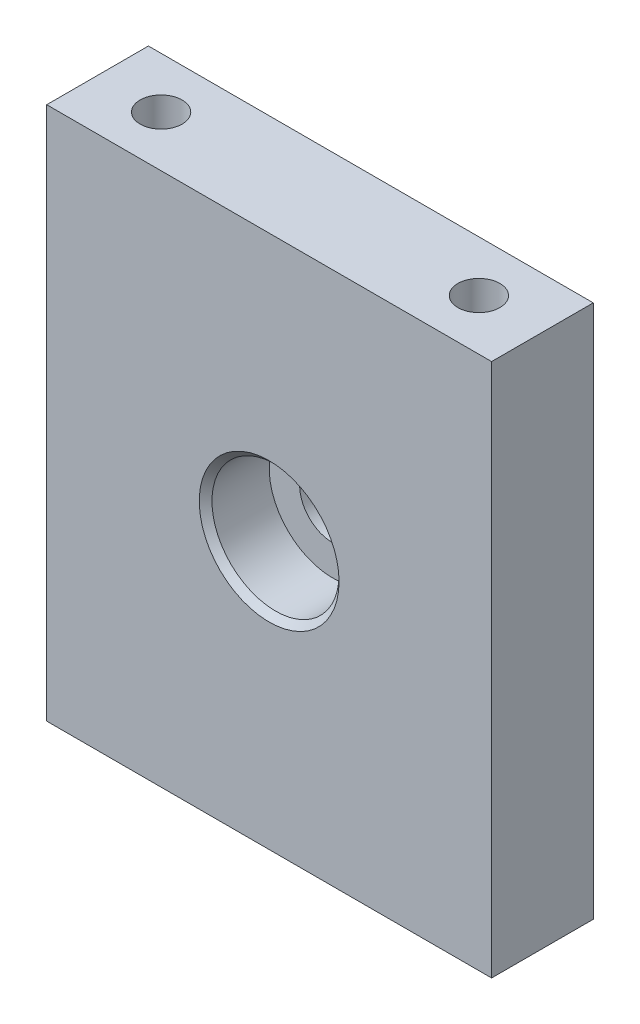
ISO-10303-21;
HEADER;
FILE_DESCRIPTION(('STEP AP214'),'2;1');
FILE_NAME('part.step','',(''),(''),'','','');
FILE_SCHEMA(('AUTOMOTIVE_DESIGN { 1 0 10303 214 1 1 1 1 }'));
ENDSEC;
DATA;
#1=APPLICATION_CONTEXT('core data for automotive mechanical design processes');
#2=APPLICATION_PROTOCOL_DEFINITION('international standard','automotive_design',2000,#1);
#3=PRODUCT_CONTEXT('',#1,'mechanical');
#4=PRODUCT('Part','Part','',(#3));
#5=PRODUCT_RELATED_PRODUCT_CATEGORY('part','',(#4));
#6=PRODUCT_DEFINITION_FORMATION('','',#4);
#7=PRODUCT_DEFINITION_CONTEXT('part definition',#1,'design');
#8=PRODUCT_DEFINITION('design','',#6,#7);
#9=PRODUCT_DEFINITION_SHAPE('','',#8);
#10=(LENGTH_UNIT() NAMED_UNIT(*) SI_UNIT(.MILLI.,.METRE.));
#11=(NAMED_UNIT(*) PLANE_ANGLE_UNIT() SI_UNIT($,.RADIAN.));
#12=(NAMED_UNIT(*) SI_UNIT($,.STERADIAN.) SOLID_ANGLE_UNIT());
#13=UNCERTAINTY_MEASURE_WITH_UNIT(LENGTH_MEASURE(1.E-05),#10,'distance_accuracy_value','');
#14=(GEOMETRIC_REPRESENTATION_CONTEXT(3) GLOBAL_UNCERTAINTY_ASSIGNED_CONTEXT((#13)) GLOBAL_UNIT_ASSIGNED_CONTEXT((#10,
#11,#12)) REPRESENTATION_CONTEXT('',''));
#15=CARTESIAN_POINT('',(0.,0.,0.));
#16=DIRECTION('',(0.,0.,1.));
#17=DIRECTION('',(1.,0.,0.));
#18=AXIS2_PLACEMENT_3D('',#15,#16,#17);
#19=CARTESIAN_POINT('',(0.,0.,-7.5));
#20=DIRECTION('',(0.,0.,1.));
#21=DIRECTION('',(1.,0.,0.));
#22=AXIS2_PLACEMENT_3D('',#19,#20,#21);
#23=CYLINDRICAL_SURFACE('',#22,2.6);
#24=CARTESIAN_POINT('',(0.,0.,-2.));
#25=DIRECTION('',(0.,0.,-1.));
#26=DIRECTION('',(-1.,0.,0.));
#27=AXIS2_PLACEMENT_3D('',#24,#25,#26);
#28=CIRCLE('',#27,2.6);
#29=CARTESIAN_POINT('',(-2.6,0.,-2.));
#30=VERTEX_POINT('',#29);
#31=EDGE_CURVE('E181',#30,#30,#28,.T.);
#32=ORIENTED_EDGE('',*,*,#31,.T.);
#33=EDGE_LOOP('',(#32));
#34=FACE_BOUND('',#33,.T.);
#35=CARTESIAN_POINT('',(0.,0.,-1.));
#36=DIRECTION('',(0.,0.,1.));
#37=DIRECTION('',(1.,0.,0.));
#38=AXIS2_PLACEMENT_3D('',#35,#36,#37);
#39=CIRCLE('',#38,2.6);
#40=CARTESIAN_POINT('',(2.6,0.,-1.));
#41=VERTEX_POINT('',#40);
#42=EDGE_CURVE('E184',#41,#41,#39,.F.);
#43=ORIENTED_EDGE('',*,*,#42,.F.);
#44=EDGE_LOOP('',(#43));
#45=FACE_BOUND('',#44,.T.);
#46=ADVANCED_FACE('F40',(#34,#45),#23,.F.);
#47=CARTESIAN_POINT('',(0.,0.,-4.));
#48=DIRECTION('',(0.,0.,1.));
#49=DIRECTION('',(1.,0.,0.));
#50=AXIS2_PLACEMENT_3D('',#47,#48,#49);
#51=PLANE('',#50);
#52=CARTESIAN_POINT('',(0.,0.,-4.));
#53=DIRECTION('',(0.,0.,1.));
#54=DIRECTION('',(1.,0.,0.));
#55=AXIS2_PLACEMENT_3D('',#52,#53,#54);
#56=CIRCLE('',#55,11.);
#57=CARTESIAN_POINT('',(11.,0.,-4.));
#58=VERTEX_POINT('',#57);
#59=EDGE_CURVE('E11',#58,#58,#56,.T.);
#60=ORIENTED_EDGE('',*,*,#59,.T.);
#61=EDGE_LOOP('',(#60));
#62=FACE_BOUND('',#61,.T.);
#63=DIRECTION('',(0.,1.,0.));
#64=VECTOR('',#63,1.);
#65=CARTESIAN_POINT('',(17.5,21.,-4.));
#66=LINE('',#65,#64);
#67=CARTESIAN_POINT('',(17.5,-21.,-4.));
#68=VERTEX_POINT('',#67);
#69=CARTESIAN_POINT('',(17.5,21.,-4.));
#70=VERTEX_POINT('',#69);
#71=EDGE_CURVE('E218',#68,#70,#66,.T.);
#72=ORIENTED_EDGE('',*,*,#71,.F.);
#73=DIRECTION('',(1.,0.,0.));
#74=VECTOR('',#73,1.);
#75=CARTESIAN_POINT('',(-17.5,-21.,-4.));
#76=LINE('',#75,#74);
#77=CARTESIAN_POINT('',(-17.5,-21.,-4.));
#78=VERTEX_POINT('',#77);
#79=EDGE_CURVE('E223',#78,#68,#76,.T.);
#80=ORIENTED_EDGE('',*,*,#79,.F.);
#81=DIRECTION('',(0.,-1.,0.));
#82=VECTOR('',#81,1.);
#83=CARTESIAN_POINT('',(-17.5,21.,-4.));
#84=LINE('',#83,#82);
#85=CARTESIAN_POINT('',(-17.5,21.,-4.));
#86=VERTEX_POINT('',#85);
#87=EDGE_CURVE('E234',#86,#78,#84,.T.);
#88=ORIENTED_EDGE('',*,*,#87,.F.);
#89=DIRECTION('',(-1.,0.,0.));
#90=VECTOR('',#89,1.);
#91=CARTESIAN_POINT('',(-17.5,21.,-4.));
#92=LINE('',#91,#90);
#93=EDGE_CURVE('E232',#70,#86,#92,.T.);
#94=ORIENTED_EDGE('',*,*,#93,.F.);
#95=EDGE_LOOP('',(#72,#80,#88,#94));
#96=FACE_BOUND('',#95,.T.);
#97=ADVANCED_FACE('F330',(#62,#96),#51,.F.);
#98=CARTESIAN_POINT('',(17.5,21.,4.));
#99=DIRECTION('',(-1.,0.,0.));
#100=DIRECTION('',(0.,-1.,0.));
#101=AXIS2_PLACEMENT_3D('',#98,#99,#100);
#102=PLANE('',#101);
#103=ORIENTED_EDGE('',*,*,#71,.T.);
#104=DIRECTION('',(0.,0.,-1.));
#105=VECTOR('',#104,1.);
#106=CARTESIAN_POINT('',(17.5,21.,4.));
#107=LINE('',#106,#105);
#108=CARTESIAN_POINT('',(17.5,21.,4.));
#109=VERTEX_POINT('',#108);
#110=EDGE_CURVE('E245',#109,#70,#107,.T.);
#111=ORIENTED_EDGE('',*,*,#110,.F.);
#112=DIRECTION('',(0.,1.,0.));
#113=VECTOR('',#112,1.);
#114=CARTESIAN_POINT('',(17.5,21.,4.));
#115=LINE('',#114,#113);
#116=CARTESIAN_POINT('',(17.5,-21.,4.));
#117=VERTEX_POINT('',#116);
#118=EDGE_CURVE('E219',#117,#109,#115,.T.);
#119=ORIENTED_EDGE('',*,*,#118,.F.);
#120=DIRECTION('',(0.,0.,-1.));
#121=VECTOR('',#120,1.);
#122=CARTESIAN_POINT('',(17.5,-21.,4.));
#123=LINE('',#122,#121);
#124=EDGE_CURVE('E229',#117,#68,#123,.T.);
#125=ORIENTED_EDGE('',*,*,#124,.T.);
#126=EDGE_LOOP('',(#103,#111,#119,#125));
#127=FACE_BOUND('',#126,.T.);
#128=ADVANCED_FACE('F336',(#127),#102,.F.);
#129=CARTESIAN_POINT('',(-17.5,21.,4.));
#130=DIRECTION('',(0.,-1.,0.));
#131=DIRECTION('',(0.,0.,-1.));
#132=AXIS2_PLACEMENT_3D('',#129,#130,#131);
#133=PLANE('',#132);
#134=CARTESIAN_POINT('',(-12.5,21.,0.));
#135=DIRECTION('',(0.,1.,0.));
#136=DIRECTION('',(0.,0.,1.));
#137=AXIS2_PLACEMENT_3D('',#134,#135,#136);
#138=CIRCLE('',#137,1.64999999999999);
#139=CARTESIAN_POINT('',(-12.5,21.,1.64999999999999));
#140=VERTEX_POINT('',#139);
#141=EDGE_CURVE('E515',#140,#140,#138,.T.);
#142=ORIENTED_EDGE('',*,*,#141,.F.);
#143=EDGE_LOOP('',(#142));
#144=FACE_BOUND('',#143,.T.);
#145=CARTESIAN_POINT('',(12.5,21.,0.));
#146=DIRECTION('',(0.,1.,0.));
#147=DIRECTION('',(0.,0.,1.));
#148=AXIS2_PLACEMENT_3D('',#145,#146,#147);
#149=CIRCLE('',#148,1.64999999999999);
#150=CARTESIAN_POINT('',(12.5,21.,1.64999999999998));
#151=VERTEX_POINT('',#150);
#152=EDGE_CURVE('E517',#151,#151,#149,.T.);
#153=ORIENTED_EDGE('',*,*,#152,.F.);
#154=EDGE_LOOP('',(#153));
#155=FACE_BOUND('',#154,.T.);
#156=ORIENTED_EDGE('',*,*,#93,.T.);
#157=DIRECTION('',(0.,0.,-1.));
#158=VECTOR('',#157,1.);
#159=CARTESIAN_POINT('',(-17.5,21.,4.));
#160=LINE('',#159,#158);
#161=CARTESIAN_POINT('',(-17.5,21.,4.));
#162=VERTEX_POINT('',#161);
#163=EDGE_CURVE('E242',#162,#86,#160,.T.);
#164=ORIENTED_EDGE('',*,*,#163,.F.);
#165=DIRECTION('',(-1.,0.,0.));
#166=VECTOR('',#165,1.);
#167=CARTESIAN_POINT('',(-17.5,21.,4.));
#168=LINE('',#167,#166);
#169=EDGE_CURVE('E222',#109,#162,#168,.T.);
#170=ORIENTED_EDGE('',*,*,#169,.F.);
#171=ORIENTED_EDGE('',*,*,#110,.T.);
#172=EDGE_LOOP('',(#156,#164,#170,#171));
#173=FACE_BOUND('',#172,.T.);
#174=ADVANCED_FACE('F391',(#144,#155,#173),#133,.F.);
#175=CARTESIAN_POINT('',(-17.5,21.,4.));
#176=DIRECTION('',(1.,0.,0.));
#177=DIRECTION('',(0.,1.,0.));
#178=AXIS2_PLACEMENT_3D('',#175,#176,#177);
#179=PLANE('',#178);
#180=ORIENTED_EDGE('',*,*,#87,.T.);
#181=DIRECTION('',(0.,0.,-1.));
#182=VECTOR('',#181,1.);
#183=CARTESIAN_POINT('',(-17.5,-21.,4.));
#184=LINE('',#183,#182);
#185=CARTESIAN_POINT('',(-17.5,-21.,4.));
#186=VERTEX_POINT('',#185);
#187=EDGE_CURVE('E239',#186,#78,#184,.T.);
#188=ORIENTED_EDGE('',*,*,#187,.F.);
#189=DIRECTION('',(0.,-1.,0.));
#190=VECTOR('',#189,1.);
#191=CARTESIAN_POINT('',(-17.5,21.,4.));
#192=LINE('',#191,#190);
#193=EDGE_CURVE('E225',#162,#186,#192,.T.);
#194=ORIENTED_EDGE('',*,*,#193,.F.);
#195=ORIENTED_EDGE('',*,*,#163,.T.);
#196=EDGE_LOOP('',(#180,#188,#194,#195));
#197=FACE_BOUND('',#196,.T.);
#198=ADVANCED_FACE('F387',(#197),#179,.F.);
#199=CARTESIAN_POINT('',(-17.5,-21.,4.));
#200=DIRECTION('',(0.,1.,0.));
#201=DIRECTION('',(0.,0.,1.));
#202=AXIS2_PLACEMENT_3D('',#199,#200,#201);
#203=PLANE('',#202);
#204=CARTESIAN_POINT('',(-12.5,-21.,0.));
#205=DIRECTION('',(0.,1.,0.));
#206=DIRECTION('',(0.,0.,1.));
#207=AXIS2_PLACEMENT_3D('',#204,#205,#206);
#208=CIRCLE('',#207,1.64999999999999);
#209=CARTESIAN_POINT('',(-12.5,-21.,1.64999999999999));
#210=VERTEX_POINT('',#209);
#211=EDGE_CURVE('E512',#210,#210,#208,.T.);
#212=ORIENTED_EDGE('',*,*,#211,.T.);
#213=EDGE_LOOP('',(#212));
#214=FACE_BOUND('',#213,.T.);
#215=CARTESIAN_POINT('',(12.5,-21.,0.));
#216=DIRECTION('',(0.,1.,0.));
#217=DIRECTION('',(0.,0.,1.));
#218=AXIS2_PLACEMENT_3D('',#215,#216,#217);
#219=CIRCLE('',#218,1.64999999999999);
#220=CARTESIAN_POINT('',(12.5,-21.,1.64999999999999));
#221=VERTEX_POINT('',#220);
#222=EDGE_CURVE('E285',#221,#221,#219,.T.);
#223=ORIENTED_EDGE('',*,*,#222,.T.);
#224=EDGE_LOOP('',(#223));
#225=FACE_BOUND('',#224,.T.);
#226=ORIENTED_EDGE('',*,*,#79,.T.);
#227=ORIENTED_EDGE('',*,*,#124,.F.);
#228=DIRECTION('',(1.,0.,0.));
#229=VECTOR('',#228,1.);
#230=CARTESIAN_POINT('',(-17.5,-21.,4.));
#231=LINE('',#230,#229);
#232=EDGE_CURVE('E227',#186,#117,#231,.T.);
#233=ORIENTED_EDGE('',*,*,#232,.F.);
#234=ORIENTED_EDGE('',*,*,#187,.T.);
#235=EDGE_LOOP('',(#226,#227,#233,#234));
#236=FACE_BOUND('',#235,.T.);
#237=ADVANCED_FACE('F382',(#214,#225,#236),#203,.F.);
#238=CARTESIAN_POINT('',(0.,0.,4.));
#239=DIRECTION('',(0.,0.,1.));
#240=DIRECTION('',(1.,0.,0.));
#241=AXIS2_PLACEMENT_3D('',#238,#239,#240);
#242=PLANE('',#241);
#243=CARTESIAN_POINT('',(0.,0.,4.));
#244=DIRECTION('',(0.,0.,1.));
#245=DIRECTION('',(1.,0.,0.));
#246=AXIS2_PLACEMENT_3D('',#243,#244,#245);
#247=CIRCLE('',#246,5.50000000000001);
#248=CARTESIAN_POINT('',(5.50000000000001,0.,4.));
#249=VERTEX_POINT('',#248);
#250=EDGE_CURVE('E307',#249,#249,#247,.F.);
#251=ORIENTED_EDGE('',*,*,#250,.T.);
#252=EDGE_LOOP('',(#251));
#253=FACE_BOUND('',#252,.T.);
#254=ORIENTED_EDGE('',*,*,#118,.T.);
#255=ORIENTED_EDGE('',*,*,#169,.T.);
#256=ORIENTED_EDGE('',*,*,#193,.T.);
#257=ORIENTED_EDGE('',*,*,#232,.T.);
#258=EDGE_LOOP('',(#254,#255,#256,#257));
#259=FACE_BOUND('',#258,.T.);
#260=ADVANCED_FACE('F377',(#253,#259),#242,.T.);
#261=CARTESIAN_POINT('',(0.,0.,-7.5));
#262=DIRECTION('',(0.,0.,-1.));
#263=DIRECTION('',(-1.,0.,0.));
#264=AXIS2_PLACEMENT_3D('',#261,#262,#263);
#265=PLANE('',#264);
#266=CARTESIAN_POINT('',(5.,5.,-7.5));
#267=DIRECTION('',(0.,0.,-1.));
#268=DIRECTION('',(-1.,0.,0.));
#269=AXIS2_PLACEMENT_3D('',#266,#267,#268);
#270=CIRCLE('',#269,1.5);
#271=CARTESIAN_POINT('',(6.5,4.99999999999999,-7.5));
#272=VERTEX_POINT('',#271);
#273=CARTESIAN_POINT('',(4.99999999999999,6.5,-7.5));
#274=VERTEX_POINT('',#273);
#275=EDGE_CURVE('E265',#272,#274,#270,.F.);
#276=ORIENTED_EDGE('',*,*,#275,.T.);
#277=DIRECTION('',(-1.,0.,0.));
#278=VECTOR('',#277,1.);
#279=CARTESIAN_POINT('',(0.,6.5,-7.5));
#280=LINE('',#279,#278);
#281=CARTESIAN_POINT('',(-4.99999999999999,6.5,-7.5));
#282=VERTEX_POINT('',#281);
#283=EDGE_CURVE('E267',#274,#282,#280,.T.);
#284=ORIENTED_EDGE('',*,*,#283,.T.);
#285=CARTESIAN_POINT('',(-5.,5.,-7.5));
#286=DIRECTION('',(0.,0.,-1.));
#287=DIRECTION('',(-1.,0.,0.));
#288=AXIS2_PLACEMENT_3D('',#285,#286,#287);
#289=CIRCLE('',#288,1.5);
#290=CARTESIAN_POINT('',(-6.5,4.99999999999999,-7.5));
#291=VERTEX_POINT('',#290);
#292=EDGE_CURVE('E263',#282,#291,#289,.F.);
#293=ORIENTED_EDGE('',*,*,#292,.T.);
#294=DIRECTION('',(0.,-1.,0.));
#295=VECTOR('',#294,1.);
#296=CARTESIAN_POINT('',(-6.5,0.,-7.5));
#297=LINE('',#296,#295);
#298=CARTESIAN_POINT('',(-6.5,-5.,-7.5));
#299=VERTEX_POINT('',#298);
#300=EDGE_CURVE('E259',#291,#299,#297,.T.);
#301=ORIENTED_EDGE('',*,*,#300,.T.);
#302=CARTESIAN_POINT('',(-5.,-5.,-7.5));
#303=DIRECTION('',(0.,0.,-1.));
#304=DIRECTION('',(-1.,0.,0.));
#305=AXIS2_PLACEMENT_3D('',#302,#303,#304);
#306=CIRCLE('',#305,1.5);
#307=CARTESIAN_POINT('',(-4.99999999999999,-6.5,-7.5));
#308=VERTEX_POINT('',#307);
#309=EDGE_CURVE('E255',#299,#308,#306,.F.);
#310=ORIENTED_EDGE('',*,*,#309,.T.);
#311=DIRECTION('',(1.,0.,0.));
#312=VECTOR('',#311,1.);
#313=CARTESIAN_POINT('',(0.,-6.5,-7.5));
#314=LINE('',#313,#312);
#315=CARTESIAN_POINT('',(4.99999999999999,-6.5,-7.5));
#316=VERTEX_POINT('',#315);
#317=EDGE_CURVE('E253',#308,#316,#314,.T.);
#318=ORIENTED_EDGE('',*,*,#317,.T.);
#319=CARTESIAN_POINT('',(5.,-5.,-7.5));
#320=DIRECTION('',(0.,0.,-1.));
#321=DIRECTION('',(-1.,0.,0.));
#322=AXIS2_PLACEMENT_3D('',#319,#320,#321);
#323=CIRCLE('',#322,1.5);
#324=CARTESIAN_POINT('',(6.5,-4.99999999999999,-7.5));
#325=VERTEX_POINT('',#324);
#326=EDGE_CURVE('E257',#316,#325,#323,.F.);
#327=ORIENTED_EDGE('',*,*,#326,.T.);
#328=DIRECTION('',(0.,1.,0.));
#329=VECTOR('',#328,1.);
#330=CARTESIAN_POINT('',(6.5,0.,-7.5));
#331=LINE('',#330,#329);
#332=EDGE_CURVE('E261',#325,#272,#331,.T.);
#333=ORIENTED_EDGE('',*,*,#332,.T.);
#334=EDGE_LOOP('',(#276,#284,#293,#301,#310,#318,#327,#333));
#335=FACE_BOUND('',#334,.T.);
#336=CARTESIAN_POINT('',(0.,0.,-7.5));
#337=DIRECTION('',(0.,0.,-1.));
#338=DIRECTION('',(-1.,0.,0.));
#339=AXIS2_PLACEMENT_3D('',#336,#337,#338);
#340=CIRCLE('',#339,10.);
#341=CARTESIAN_POINT('',(-10.,0.,-7.5));
#342=VERTEX_POINT('',#341);
#343=EDGE_CURVE('E215',#342,#342,#340,.T.);
#344=ORIENTED_EDGE('',*,*,#343,.T.);
#345=EDGE_LOOP('',(#344));
#346=FACE_BOUND('',#345,.T.);
#347=ADVANCED_FACE('F374',(#335,#346),#265,.T.);
#348=CARTESIAN_POINT('',(0.,0.,-7.5));
#349=DIRECTION('',(0.,0.,1.));
#350=DIRECTION('',(1.,0.,0.));
#351=AXIS2_PLACEMENT_3D('',#348,#349,#350);
#352=CYLINDRICAL_SURFACE('',#351,10.);
#353=CARTESIAN_POINT('',(0.,0.,-5.));
#354=DIRECTION('',(0.,0.,1.));
#355=DIRECTION('',(1.,0.,0.));
#356=AXIS2_PLACEMENT_3D('',#353,#354,#355);
#357=CIRCLE('',#356,10.);
#358=CARTESIAN_POINT('',(10.,0.,-5.));
#359=VERTEX_POINT('',#358);
#360=EDGE_CURVE('E49',#359,#359,#357,.F.);
#361=ORIENTED_EDGE('',*,*,#360,.T.);
#362=EDGE_LOOP('',(#361));
#363=FACE_BOUND('',#362,.T.);
#364=ORIENTED_EDGE('',*,*,#343,.F.);
#365=EDGE_LOOP('',(#364));
#366=FACE_BOUND('',#365,.T.);
#367=ADVANCED_FACE('F312',(#363,#366),#352,.T.);
#368=CARTESIAN_POINT('',(-5.,5.,-7.5));
#369=DIRECTION('',(0.,0.,1.));
#370=DIRECTION('',(1.,0.,0.));
#371=AXIS2_PLACEMENT_3D('',#368,#369,#370);
#372=CYLINDRICAL_SURFACE('',#371,1.);
#373=DIRECTION('',(0.,0.,1.));
#374=VECTOR('',#373,1.);
#375=CARTESIAN_POINT('',(-6.,4.99999999999999,-7.5));
#376=LINE('',#375,#374);
#377=CARTESIAN_POINT('',(-6.,4.99999999999999,-7.));
#378=VERTEX_POINT('',#377);
#379=CARTESIAN_POINT('',(-6.,4.99999999999999,-2.));
#380=VERTEX_POINT('',#379);
#381=EDGE_CURVE('E166',#378,#380,#376,.T.);
#382=ORIENTED_EDGE('',*,*,#381,.F.);
#383=CARTESIAN_POINT('',(-5.,5.,-7.));
#384=DIRECTION('',(0.,0.,-1.));
#385=DIRECTION('',(-1.,0.,0.));
#386=AXIS2_PLACEMENT_3D('',#383,#384,#385);
#387=CIRCLE('',#386,1.);
#388=CARTESIAN_POINT('',(-4.99999999999999,6.,-7.));
#389=VERTEX_POINT('',#388);
#390=EDGE_CURVE('E272',#378,#389,#387,.T.);
#391=ORIENTED_EDGE('',*,*,#390,.T.);
#392=DIRECTION('',(0.,0.,1.));
#393=VECTOR('',#392,1.);
#394=CARTESIAN_POINT('',(-4.99999999999999,6.,-7.5));
#395=LINE('',#394,#393);
#396=CARTESIAN_POINT('',(-4.99999999999999,6.,-2.));
#397=VERTEX_POINT('',#396);
#398=EDGE_CURVE('E213',#389,#397,#395,.T.);
#399=ORIENTED_EDGE('',*,*,#398,.T.);
#400=CARTESIAN_POINT('',(-5.,5.,-2.));
#401=DIRECTION('',(0.,0.,-1.));
#402=DIRECTION('',(-1.,0.,0.));
#403=AXIS2_PLACEMENT_3D('',#400,#401,#402);
#404=CIRCLE('',#403,1.);
#405=EDGE_CURVE('E175',#380,#397,#404,.T.);
#406=ORIENTED_EDGE('',*,*,#405,.F.);
#407=EDGE_LOOP('',(#382,#391,#399,#406));
#408=FACE_BOUND('',#407,.T.);
#409=ADVANCED_FACE('F369',(#408),#372,.F.);
#410=CARTESIAN_POINT('',(4.99999999999999,6.,-7.5));
#411=DIRECTION('',(0.,-1.,0.));
#412=DIRECTION('',(0.,0.,-1.));
#413=AXIS2_PLACEMENT_3D('',#410,#411,#412);
#414=PLANE('',#413);
#415=ORIENTED_EDGE('',*,*,#398,.F.);
#416=DIRECTION('',(1.,0.,0.));
#417=VECTOR('',#416,1.);
#418=CARTESIAN_POINT('',(4.99999999999999,6.,-7.));
#419=LINE('',#418,#417);
#420=CARTESIAN_POINT('',(4.99999999999999,6.,-7.));
#421=VERTEX_POINT('',#420);
#422=EDGE_CURVE('E247',#389,#421,#419,.T.);
#423=ORIENTED_EDGE('',*,*,#422,.T.);
#424=DIRECTION('',(0.,0.,1.));
#425=VECTOR('',#424,1.);
#426=CARTESIAN_POINT('',(4.99999999999999,6.,-7.5));
#427=LINE('',#426,#425);
#428=CARTESIAN_POINT('',(4.99999999999999,6.,-2.));
#429=VERTEX_POINT('',#428);
#430=EDGE_CURVE('E211',#421,#429,#427,.T.);
#431=ORIENTED_EDGE('',*,*,#430,.T.);
#432=DIRECTION('',(1.,0.,0.));
#433=VECTOR('',#432,1.);
#434=CARTESIAN_POINT('',(-4.99999999999999,6.,-2.));
#435=LINE('',#434,#433);
#436=EDGE_CURVE('E191',#397,#429,#435,.T.);
#437=ORIENTED_EDGE('',*,*,#436,.F.);
#438=EDGE_LOOP('',(#415,#423,#431,#437));
#439=FACE_BOUND('',#438,.T.);
#440=ADVANCED_FACE('F365',(#439),#414,.T.);
#441=CARTESIAN_POINT('',(5.,5.,-7.5));
#442=DIRECTION('',(0.,0.,1.));
#443=DIRECTION('',(1.,0.,0.));
#444=AXIS2_PLACEMENT_3D('',#441,#442,#443);
#445=CYLINDRICAL_SURFACE('',#444,1.);
#446=ORIENTED_EDGE('',*,*,#430,.F.);
#447=CARTESIAN_POINT('',(5.,5.,-7.));
#448=DIRECTION('',(0.,0.,-1.));
#449=DIRECTION('',(-1.,0.,0.));
#450=AXIS2_PLACEMENT_3D('',#447,#448,#449);
#451=CIRCLE('',#450,1.);
#452=CARTESIAN_POINT('',(6.,4.99999999999999,-7.));
#453=VERTEX_POINT('',#452);
#454=EDGE_CURVE('E270',#421,#453,#451,.T.);
#455=ORIENTED_EDGE('',*,*,#454,.T.);
#456=DIRECTION('',(0.,0.,1.));
#457=VECTOR('',#456,1.);
#458=CARTESIAN_POINT('',(6.,4.99999999999999,-7.5));
#459=LINE('',#458,#457);
#460=CARTESIAN_POINT('',(6.,4.99999999999999,-2.));
#461=VERTEX_POINT('',#460);
#462=EDGE_CURVE('E209',#453,#461,#459,.T.);
#463=ORIENTED_EDGE('',*,*,#462,.T.);
#464=CARTESIAN_POINT('',(5.,5.,-2.));
#465=DIRECTION('',(0.,0.,-1.));
#466=DIRECTION('',(-1.,0.,0.));
#467=AXIS2_PLACEMENT_3D('',#464,#465,#466);
#468=CIRCLE('',#467,1.);
#469=EDGE_CURVE('E194',#429,#461,#468,.T.);
#470=ORIENTED_EDGE('',*,*,#469,.F.);
#471=EDGE_LOOP('',(#446,#455,#463,#470));
#472=FACE_BOUND('',#471,.T.);
#473=ADVANCED_FACE('F361',(#472),#445,.F.);
#474=CARTESIAN_POINT('',(6.,4.99999999999999,-7.5));
#475=DIRECTION('',(-1.,0.,0.));
#476=DIRECTION('',(0.,-1.,0.));
#477=AXIS2_PLACEMENT_3D('',#474,#475,#476);
#478=PLANE('',#477);
#479=ORIENTED_EDGE('',*,*,#462,.F.);
#480=DIRECTION('',(0.,-1.,0.));
#481=VECTOR('',#480,1.);
#482=CARTESIAN_POINT('',(6.,4.99999999999999,-7.));
#483=LINE('',#482,#481);
#484=CARTESIAN_POINT('',(6.,-4.99999999999999,-7.));
#485=VERTEX_POINT('',#484);
#486=EDGE_CURVE('E274',#453,#485,#483,.T.);
#487=ORIENTED_EDGE('',*,*,#486,.T.);
#488=DIRECTION('',(0.,0.,1.));
#489=VECTOR('',#488,1.);
#490=CARTESIAN_POINT('',(6.,-4.99999999999999,-7.5));
#491=LINE('',#490,#489);
#492=CARTESIAN_POINT('',(6.,-4.99999999999999,-2.));
#493=VERTEX_POINT('',#492);
#494=EDGE_CURVE('E207',#485,#493,#491,.T.);
#495=ORIENTED_EDGE('',*,*,#494,.T.);
#496=DIRECTION('',(0.,-1.,0.));
#497=VECTOR('',#496,1.);
#498=CARTESIAN_POINT('',(6.,4.99999999999999,-2.));
#499=LINE('',#498,#497);
#500=EDGE_CURVE('E197',#461,#493,#499,.T.);
#501=ORIENTED_EDGE('',*,*,#500,.F.);
#502=EDGE_LOOP('',(#479,#487,#495,#501));
#503=FACE_BOUND('',#502,.T.);
#504=ADVANCED_FACE('F358',(#503),#478,.T.);
#505=CARTESIAN_POINT('',(5.,-5.,-7.5));
#506=DIRECTION('',(0.,0.,1.));
#507=DIRECTION('',(1.,0.,0.));
#508=AXIS2_PLACEMENT_3D('',#505,#506,#507);
#509=CYLINDRICAL_SURFACE('',#508,1.);
#510=ORIENTED_EDGE('',*,*,#494,.F.);
#511=CARTESIAN_POINT('',(5.,-5.,-7.));
#512=DIRECTION('',(0.,0.,-1.));
#513=DIRECTION('',(-1.,0.,0.));
#514=AXIS2_PLACEMENT_3D('',#511,#512,#513);
#515=CIRCLE('',#514,1.);
#516=CARTESIAN_POINT('',(4.99999999999999,-6.,-7.));
#517=VERTEX_POINT('',#516);
#518=EDGE_CURVE('E64',#485,#517,#515,.T.);
#519=ORIENTED_EDGE('',*,*,#518,.T.);
#520=DIRECTION('',(0.,0.,1.));
#521=VECTOR('',#520,1.);
#522=CARTESIAN_POINT('',(4.99999999999999,-6.,-7.5));
#523=LINE('',#522,#521);
#524=CARTESIAN_POINT('',(4.99999999999999,-6.,-2.));
#525=VERTEX_POINT('',#524);
#526=EDGE_CURVE('E205',#517,#525,#523,.T.);
#527=ORIENTED_EDGE('',*,*,#526,.T.);
#528=CARTESIAN_POINT('',(5.,-5.,-2.));
#529=DIRECTION('',(0.,0.,-1.));
#530=DIRECTION('',(-1.,0.,0.));
#531=AXIS2_PLACEMENT_3D('',#528,#529,#530);
#532=CIRCLE('',#531,1.);
#533=EDGE_CURVE('E200',#493,#525,#532,.T.);
#534=ORIENTED_EDGE('',*,*,#533,.F.);
#535=EDGE_LOOP('',(#510,#519,#527,#534));
#536=FACE_BOUND('',#535,.T.);
#537=ADVANCED_FACE('F355',(#536),#509,.F.);
#538=CARTESIAN_POINT('',(4.99999999999999,-6.,-7.5));
#539=DIRECTION('',(0.,1.,0.));
#540=DIRECTION('',(0.,0.,1.));
#541=AXIS2_PLACEMENT_3D('',#538,#539,#540);
#542=PLANE('',#541);
#543=ORIENTED_EDGE('',*,*,#526,.F.);
#544=DIRECTION('',(-1.,0.,0.));
#545=VECTOR('',#544,1.);
#546=CARTESIAN_POINT('',(4.99999999999999,-6.,-7.));
#547=LINE('',#546,#545);
#548=CARTESIAN_POINT('',(-4.99999999999999,-6.,-7.));
#549=VERTEX_POINT('',#548);
#550=EDGE_CURVE('E56',#517,#549,#547,.T.);
#551=ORIENTED_EDGE('',*,*,#550,.T.);
#552=DIRECTION('',(0.,0.,1.));
#553=VECTOR('',#552,1.);
#554=CARTESIAN_POINT('',(-4.99999999999999,-6.,-7.5));
#555=LINE('',#554,#553);
#556=CARTESIAN_POINT('',(-4.99999999999999,-6.,-2.));
#557=VERTEX_POINT('',#556);
#558=EDGE_CURVE('E165',#549,#557,#555,.T.);
#559=ORIENTED_EDGE('',*,*,#558,.T.);
#560=DIRECTION('',(-1.,0.,0.));
#561=VECTOR('',#560,1.);
#562=CARTESIAN_POINT('',(4.99999999999999,-6.,-2.));
#563=LINE('',#562,#561);
#564=EDGE_CURVE('E180',#525,#557,#563,.T.);
#565=ORIENTED_EDGE('',*,*,#564,.F.);
#566=EDGE_LOOP('',(#543,#551,#559,#565));
#567=FACE_BOUND('',#566,.T.);
#568=ADVANCED_FACE('F352',(#567),#542,.T.);
#569=CARTESIAN_POINT('',(-5.,-5.,-7.5));
#570=DIRECTION('',(0.,0.,1.));
#571=DIRECTION('',(1.,0.,0.));
#572=AXIS2_PLACEMENT_3D('',#569,#570,#571);
#573=CYLINDRICAL_SURFACE('',#572,1.);
#574=ORIENTED_EDGE('',*,*,#558,.F.);
#575=CARTESIAN_POINT('',(-5.,-5.,-7.));
#576=DIRECTION('',(0.,0.,-1.));
#577=DIRECTION('',(-1.,0.,0.));
#578=AXIS2_PLACEMENT_3D('',#575,#576,#577);
#579=CIRCLE('',#578,1.);
#580=CARTESIAN_POINT('',(-6.,-5.,-7.));
#581=VERTEX_POINT('',#580);
#582=EDGE_CURVE('E162',#549,#581,#579,.T.);
#583=ORIENTED_EDGE('',*,*,#582,.T.);
#584=DIRECTION('',(0.,0.,1.));
#585=VECTOR('',#584,1.);
#586=CARTESIAN_POINT('',(-6.,-5.,-7.5));
#587=LINE('',#586,#585);
#588=CARTESIAN_POINT('',(-6.,-5.,-2.));
#589=VERTEX_POINT('',#588);
#590=EDGE_CURVE('E155',#581,#589,#587,.T.);
#591=ORIENTED_EDGE('',*,*,#590,.T.);
#592=CARTESIAN_POINT('',(-5.,-5.,-2.));
#593=DIRECTION('',(0.,0.,-1.));
#594=DIRECTION('',(-1.,0.,0.));
#595=AXIS2_PLACEMENT_3D('',#592,#593,#594);
#596=CIRCLE('',#595,1.);
#597=EDGE_CURVE('E159',#557,#589,#596,.T.);
#598=ORIENTED_EDGE('',*,*,#597,.F.);
#599=EDGE_LOOP('',(#574,#583,#591,#598));
#600=FACE_BOUND('',#599,.T.);
#601=ADVANCED_FACE('F157',(#600),#573,.F.);
#602=CARTESIAN_POINT('',(-6.,4.99999999999999,-7.5));
#603=DIRECTION('',(1.,0.,0.));
#604=DIRECTION('',(0.,1.,0.));
#605=AXIS2_PLACEMENT_3D('',#602,#603,#604);
#606=PLANE('',#605);
#607=ORIENTED_EDGE('',*,*,#590,.F.);
#608=DIRECTION('',(0.,1.,0.));
#609=VECTOR('',#608,1.);
#610=CARTESIAN_POINT('',(-6.,4.99999999999999,-7.));
#611=LINE('',#610,#609);
#612=EDGE_CURVE('E276',#581,#378,#611,.T.);
#613=ORIENTED_EDGE('',*,*,#612,.T.);
#614=ORIENTED_EDGE('',*,*,#381,.T.);
#615=DIRECTION('',(0.,1.,0.));
#616=VECTOR('',#615,1.);
#617=CARTESIAN_POINT('',(-6.,-5.,-2.));
#618=LINE('',#617,#616);
#619=EDGE_CURVE('E169',#589,#380,#618,.T.);
#620=ORIENTED_EDGE('',*,*,#619,.F.);
#621=EDGE_LOOP('',(#607,#613,#614,#620));
#622=FACE_BOUND('',#621,.T.);
#623=ADVANCED_FACE('F170',(#622),#606,.T.);
#624=CARTESIAN_POINT('',(-5.,-5.,-2.));
#625=DIRECTION('',(0.,0.,-1.));
#626=DIRECTION('',(-1.,0.,0.));
#627=AXIS2_PLACEMENT_3D('',#624,#625,#626);
#628=PLANE('',#627);
#629=ORIENTED_EDGE('',*,*,#31,.F.);
#630=EDGE_LOOP('',(#629));
#631=FACE_BOUND('',#630,.T.);
#632=ORIENTED_EDGE('',*,*,#597,.T.);
#633=ORIENTED_EDGE('',*,*,#619,.T.);
#634=ORIENTED_EDGE('',*,*,#405,.T.);
#635=ORIENTED_EDGE('',*,*,#436,.T.);
#636=ORIENTED_EDGE('',*,*,#469,.T.);
#637=ORIENTED_EDGE('',*,*,#500,.T.);
#638=ORIENTED_EDGE('',*,*,#533,.T.);
#639=ORIENTED_EDGE('',*,*,#564,.T.);
#640=EDGE_LOOP('',(#632,#633,#634,#635,#636,#637,#638,#639));
#641=FACE_BOUND('',#640,.T.);
#642=ADVANCED_FACE('F177',(#631,#641),#628,.T.);
#643=CARTESIAN_POINT('',(0.,0.,-1.));
#644=DIRECTION('',(0.,0.,1.));
#645=DIRECTION('',(1.,0.,0.));
#646=AXIS2_PLACEMENT_3D('',#643,#644,#645);
#647=PLANE('',#646);
#648=CARTESIAN_POINT('',(0.,0.,-1.));
#649=DIRECTION('',(0.,0.,1.));
#650=DIRECTION('',(1.,0.,0.));
#651=AXIS2_PLACEMENT_3D('',#648,#649,#650);
#652=CIRCLE('',#651,5.);
#653=CARTESIAN_POINT('',(5.,0.,-1.));
#654=VERTEX_POINT('',#653);
#655=EDGE_CURVE('E187',#654,#654,#652,.T.);
#656=ORIENTED_EDGE('',*,*,#655,.T.);
#657=EDGE_LOOP('',(#656));
#658=FACE_BOUND('',#657,.T.);
#659=ORIENTED_EDGE('',*,*,#42,.T.);
#660=EDGE_LOOP('',(#659));
#661=FACE_BOUND('',#660,.T.);
#662=ADVANCED_FACE('F346',(#658,#661),#647,.T.);
#663=CARTESIAN_POINT('',(0.,0.,-1.));
#664=DIRECTION('',(0.,0.,1.));
#665=DIRECTION('',(1.,0.,0.));
#666=AXIS2_PLACEMENT_3D('',#663,#664,#665);
#667=CYLINDRICAL_SURFACE('',#666,5.);
#668=CARTESIAN_POINT('',(0.,0.,3.49999999999999));
#669=DIRECTION('',(0.,0.,1.));
#670=DIRECTION('',(1.,0.,0.));
#671=AXIS2_PLACEMENT_3D('',#668,#669,#670);
#672=CIRCLE('',#671,5.);
#673=CARTESIAN_POINT('',(5.,0.,3.49999999999999));
#674=VERTEX_POINT('',#673);
#675=EDGE_CURVE('E281',#674,#674,#672,.T.);
#676=ORIENTED_EDGE('',*,*,#675,.T.);
#677=EDGE_LOOP('',(#676));
#678=FACE_BOUND('',#677,.T.);
#679=ORIENTED_EDGE('',*,*,#655,.F.);
#680=EDGE_LOOP('',(#679));
#681=FACE_BOUND('',#680,.T.);
#682=ADVANCED_FACE('F342',(#678,#681),#667,.F.);
#683=CARTESIAN_POINT('',(4.99999999999999,-6.,-7.));
#684=DIRECTION('',(0.,-0.707106781186547,0.707106781186547));
#685=DIRECTION('',(-1.,0.,0.));
#686=AXIS2_PLACEMENT_3D('',#683,#684,#685);
#687=PLANE('',#686);
#688=DIRECTION('',(0.,0.707106781186547,0.707106781186547));
#689=VECTOR('',#688,1.);
#690=CARTESIAN_POINT('',(4.99999999999999,-6.5,-7.5));
#691=LINE('',#690,#689);
#692=EDGE_CURVE('E299',#316,#517,#691,.T.);
#693=ORIENTED_EDGE('',*,*,#692,.F.);
#694=ORIENTED_EDGE('',*,*,#317,.F.);
#695=DIRECTION('',(0.,-0.707106781186547,-0.707106781186547));
#696=VECTOR('',#695,1.);
#697=CARTESIAN_POINT('',(-4.99999999999999,-6.,-7.));
#698=LINE('',#697,#696);
#699=EDGE_CURVE('E302',#549,#308,#698,.T.);
#700=ORIENTED_EDGE('',*,*,#699,.F.);
#701=ORIENTED_EDGE('',*,*,#550,.F.);
#702=EDGE_LOOP('',(#693,#694,#700,#701));
#703=FACE_BOUND('',#702,.T.);
#704=ADVANCED_FACE('F448',(#703),#687,.F.);
#705=CARTESIAN_POINT('',(-5.,-5.,-7.));
#706=DIRECTION('',(0.,0.,-1.));
#707=DIRECTION('',(-1.,0.,0.));
#708=AXIS2_PLACEMENT_3D('',#705,#706,#707);
#709=CONICAL_SURFACE('',#708,1.,0.785398163397448);
#710=ORIENTED_EDGE('',*,*,#699,.T.);
#711=ORIENTED_EDGE('',*,*,#309,.F.);
#712=DIRECTION('',(-0.707106781186547,0.,-0.707106781186547));
#713=VECTOR('',#712,1.);
#714=CARTESIAN_POINT('',(-6.,-5.,-7.));
#715=LINE('',#714,#713);
#716=EDGE_CURVE('E296',#581,#299,#715,.T.);
#717=ORIENTED_EDGE('',*,*,#716,.F.);
#718=ORIENTED_EDGE('',*,*,#582,.F.);
#719=EDGE_LOOP('',(#710,#711,#717,#718));
#720=FACE_BOUND('',#719,.T.);
#721=ADVANCED_FACE('F441',(#720),#709,.F.);
#722=CARTESIAN_POINT('',(5.,-5.,-7.));
#723=DIRECTION('',(0.,0.,-1.));
#724=DIRECTION('',(-1.,0.,0.));
#725=AXIS2_PLACEMENT_3D('',#722,#723,#724);
#726=CONICAL_SURFACE('',#725,1.,0.785398163397448);
#727=ORIENTED_EDGE('',*,*,#692,.T.);
#728=ORIENTED_EDGE('',*,*,#518,.F.);
#729=DIRECTION('',(-0.707106781186547,0.,0.707106781186547));
#730=VECTOR('',#729,1.);
#731=CARTESIAN_POINT('',(6.5,-4.99999999999999,-7.5));
#732=LINE('',#731,#730);
#733=EDGE_CURVE('E293',#325,#485,#732,.T.);
#734=ORIENTED_EDGE('',*,*,#733,.F.);
#735=ORIENTED_EDGE('',*,*,#326,.F.);
#736=EDGE_LOOP('',(#727,#728,#734,#735));
#737=FACE_BOUND('',#736,.T.);
#738=ADVANCED_FACE('F434',(#737),#726,.F.);
#739=CARTESIAN_POINT('',(-6.,4.99999999999999,-7.));
#740=DIRECTION('',(-0.707106781186547,0.,0.707106781186547));
#741=DIRECTION('',(0.,1.,0.));
#742=AXIS2_PLACEMENT_3D('',#739,#740,#741);
#743=PLANE('',#742);
#744=ORIENTED_EDGE('',*,*,#716,.T.);
#745=ORIENTED_EDGE('',*,*,#300,.F.);
#746=DIRECTION('',(-0.707106781186547,0.,-0.707106781186547));
#747=VECTOR('',#746,1.);
#748=CARTESIAN_POINT('',(-6.,4.99999999999999,-7.));
#749=LINE('',#748,#747);
#750=EDGE_CURVE('E290',#378,#291,#749,.T.);
#751=ORIENTED_EDGE('',*,*,#750,.F.);
#752=ORIENTED_EDGE('',*,*,#612,.F.);
#753=EDGE_LOOP('',(#744,#745,#751,#752));
#754=FACE_BOUND('',#753,.T.);
#755=ADVANCED_FACE('F427',(#754),#743,.F.);
#756=CARTESIAN_POINT('',(6.,4.99999999999999,-7.));
#757=DIRECTION('',(0.707106781186547,0.,0.707106781186547));
#758=DIRECTION('',(0.,-1.,0.));
#759=AXIS2_PLACEMENT_3D('',#756,#757,#758);
#760=PLANE('',#759);
#761=ORIENTED_EDGE('',*,*,#733,.T.);
#762=ORIENTED_EDGE('',*,*,#486,.F.);
#763=DIRECTION('',(-0.707106781186547,0.,0.707106781186547));
#764=VECTOR('',#763,1.);
#765=CARTESIAN_POINT('',(6.5,4.99999999999999,-7.5));
#766=LINE('',#765,#764);
#767=EDGE_CURVE('E287',#272,#453,#766,.T.);
#768=ORIENTED_EDGE('',*,*,#767,.F.);
#769=ORIENTED_EDGE('',*,*,#332,.F.);
#770=EDGE_LOOP('',(#761,#762,#768,#769));
#771=FACE_BOUND('',#770,.T.);
#772=ADVANCED_FACE('F420',(#771),#760,.F.);
#773=CARTESIAN_POINT('',(-5.,5.,-7.));
#774=DIRECTION('',(0.,0.,-1.));
#775=DIRECTION('',(-1.,0.,0.));
#776=AXIS2_PLACEMENT_3D('',#773,#774,#775);
#777=CONICAL_SURFACE('',#776,1.,0.785398163397448);
#778=ORIENTED_EDGE('',*,*,#750,.T.);
#779=ORIENTED_EDGE('',*,*,#292,.F.);
#780=DIRECTION('',(0.,0.707106781186547,-0.707106781186547));
#781=VECTOR('',#780,1.);
#782=CARTESIAN_POINT('',(-4.99999999999999,6.,-7.));
#783=LINE('',#782,#781);
#784=EDGE_CURVE('E284',#389,#282,#783,.T.);
#785=ORIENTED_EDGE('',*,*,#784,.F.);
#786=ORIENTED_EDGE('',*,*,#390,.F.);
#787=EDGE_LOOP('',(#778,#779,#785,#786));
#788=FACE_BOUND('',#787,.T.);
#789=ADVANCED_FACE('F413',(#788),#777,.F.);
#790=CARTESIAN_POINT('',(5.,5.,-7.));
#791=DIRECTION('',(0.,0.,-1.));
#792=DIRECTION('',(-1.,0.,0.));
#793=AXIS2_PLACEMENT_3D('',#790,#791,#792);
#794=CONICAL_SURFACE('',#793,1.,0.785398163397448);
#795=ORIENTED_EDGE('',*,*,#767,.T.);
#796=ORIENTED_EDGE('',*,*,#454,.F.);
#797=DIRECTION('',(0.,-0.707106781186547,0.707106781186547));
#798=VECTOR('',#797,1.);
#799=CARTESIAN_POINT('',(4.99999999999999,6.5,-7.5));
#800=LINE('',#799,#798);
#801=EDGE_CURVE('E282',#274,#421,#800,.T.);
#802=ORIENTED_EDGE('',*,*,#801,.F.);
#803=ORIENTED_EDGE('',*,*,#275,.F.);
#804=EDGE_LOOP('',(#795,#796,#802,#803));
#805=FACE_BOUND('',#804,.T.);
#806=ADVANCED_FACE('F406',(#805),#794,.F.);
#807=CARTESIAN_POINT('',(4.99999999999999,6.,-7.));
#808=DIRECTION('',(0.,0.707106781186547,0.707106781186547));
#809=DIRECTION('',(1.,0.,0.));
#810=AXIS2_PLACEMENT_3D('',#807,#808,#809);
#811=PLANE('',#810);
#812=ORIENTED_EDGE('',*,*,#784,.T.);
#813=ORIENTED_EDGE('',*,*,#283,.F.);
#814=ORIENTED_EDGE('',*,*,#801,.T.);
#815=ORIENTED_EDGE('',*,*,#422,.F.);
#816=EDGE_LOOP('',(#812,#813,#814,#815));
#817=FACE_BOUND('',#816,.T.);
#818=ADVANCED_FACE('F326',(#817),#811,.F.);
#819=CARTESIAN_POINT('',(0.,0.,3.49999999999999));
#820=DIRECTION('',(0.,0.,1.));
#821=DIRECTION('',(1.,0.,0.));
#822=AXIS2_PLACEMENT_3D('',#819,#820,#821);
#823=CONICAL_SURFACE('',#822,5.,0.785398163397445);
#824=ORIENTED_EDGE('',*,*,#250,.F.);
#825=EDGE_LOOP('',(#824));
#826=FACE_BOUND('',#825,.T.);
#827=ORIENTED_EDGE('',*,*,#675,.F.);
#828=EDGE_LOOP('',(#827));
#829=FACE_BOUND('',#828,.T.);
#830=ADVANCED_FACE('F317',(#826,#829),#823,.F.);
#831=CARTESIAN_POINT('',(0.,0.,-5.));
#832=DIRECTION('',(0.,0.,1.));
#833=DIRECTION('',(1.,0.,0.));
#834=AXIS2_PLACEMENT_3D('',#831,#832,#833);
#835=CONICAL_SURFACE('',#834,10.,0.785398163397445);
#836=ORIENTED_EDGE('',*,*,#59,.F.);
#837=EDGE_LOOP('',(#836));
#838=FACE_BOUND('',#837,.T.);
#839=ORIENTED_EDGE('',*,*,#360,.F.);
#840=EDGE_LOOP('',(#839));
#841=FACE_BOUND('',#840,.T.);
#842=ADVANCED_FACE('F43',(#838,#841),#835,.T.);
#843=CARTESIAN_POINT('',(12.5,21.,0.));
#844=DIRECTION('',(0.,1.,0.));
#845=DIRECTION('',(0.,0.,1.));
#846=AXIS2_PLACEMENT_3D('',#843,#844,#845);
#847=CYLINDRICAL_SURFACE('',#846,1.64999999999999);
#848=ORIENTED_EDGE('',*,*,#222,.F.);
#849=EDGE_LOOP('',(#848));
#850=FACE_BOUND('',#849,.T.);
#851=ORIENTED_EDGE('',*,*,#152,.T.);
#852=EDGE_LOOP('',(#851));
#853=FACE_BOUND('',#852,.T.);
#854=ADVANCED_FACE('F316',(#850,#853),#847,.F.);
#855=CARTESIAN_POINT('',(-12.5,21.,0.));
#856=DIRECTION('',(0.,1.,0.));
#857=DIRECTION('',(0.,0.,1.));
#858=AXIS2_PLACEMENT_3D('',#855,#856,#857);
#859=CYLINDRICAL_SURFACE('',#858,1.64999999999999);
#860=ORIENTED_EDGE('',*,*,#211,.F.);
#861=EDGE_LOOP('',(#860));
#862=FACE_BOUND('',#861,.T.);
#863=ORIENTED_EDGE('',*,*,#141,.T.);
#864=EDGE_LOOP('',(#863));
#865=FACE_BOUND('',#864,.T.);
#866=ADVANCED_FACE('F323',(#862,#865),#859,.F.);
#867=CLOSED_SHELL('',(#46,#97,#128,#174,#198,#237,#260,#347,#367,#409,#440,#473,#504,#537,#568,
#601,#623,#642,#662,#682,#704,#721,#738,#755,#772,#789,#806,#818,#830,#842,#854,#866));
#868=MANIFOLD_SOLID_BREP('B2',#867);
#869=ADVANCED_BREP_SHAPE_REPRESENTATION('',(#18,#868),#14);
#870=SHAPE_DEFINITION_REPRESENTATION(#9,#869);
ENDSEC;
END-ISO-10303-21;
